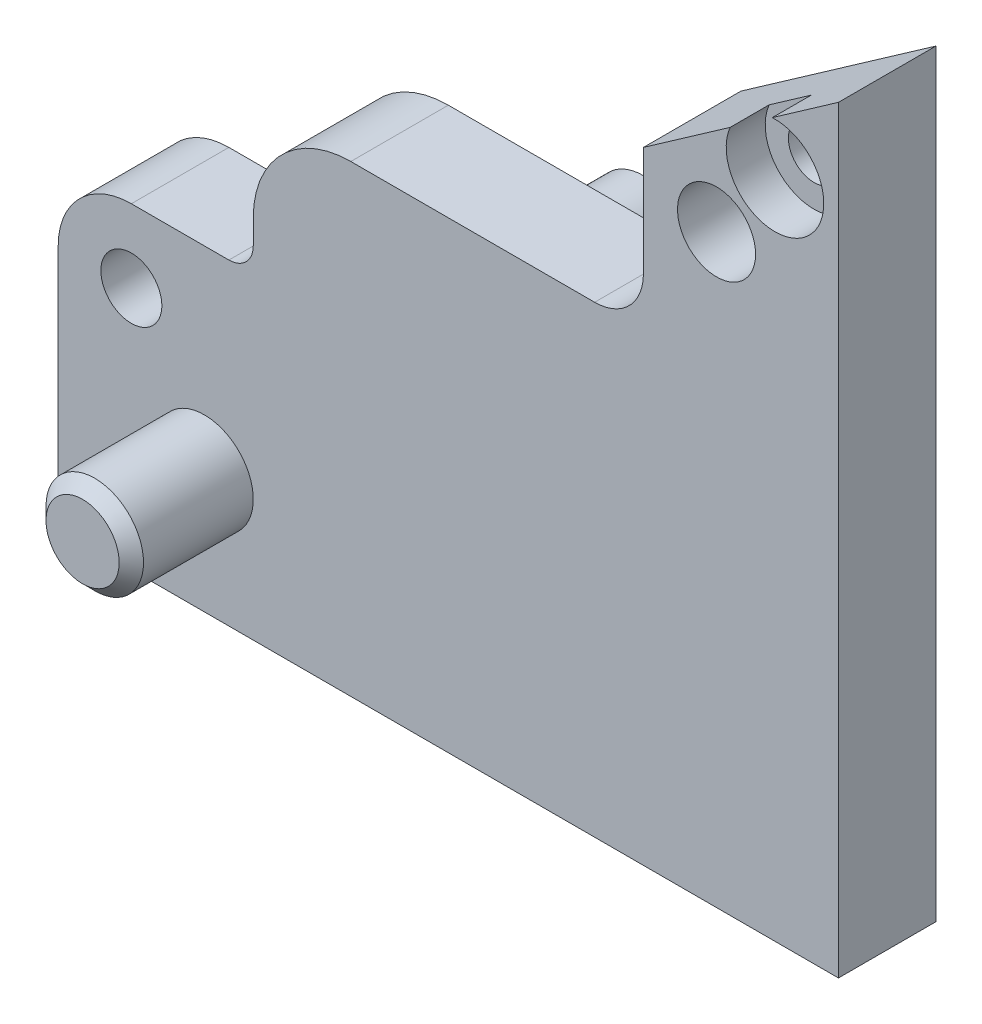
ISO-10303-21;
HEADER;
FILE_DESCRIPTION(('STEP AP214'),'2;1');
FILE_NAME('part.step','',(''),(''),'','','');
FILE_SCHEMA(('AUTOMOTIVE_DESIGN { 1 0 10303 214 1 1 1 1 }'));
ENDSEC;
DATA;
#1=APPLICATION_CONTEXT('core data for automotive mechanical design processes');
#2=APPLICATION_PROTOCOL_DEFINITION('international standard','automotive_design',2000,#1);
#3=PRODUCT_CONTEXT('',#1,'mechanical');
#4=PRODUCT('Part','Part','',(#3));
#5=PRODUCT_RELATED_PRODUCT_CATEGORY('part','',(#4));
#6=PRODUCT_DEFINITION_FORMATION('','',#4);
#7=PRODUCT_DEFINITION_CONTEXT('part definition',#1,'design');
#8=PRODUCT_DEFINITION('design','',#6,#7);
#9=PRODUCT_DEFINITION_SHAPE('','',#8);
#10=(LENGTH_UNIT() NAMED_UNIT(*) SI_UNIT(.MILLI.,.METRE.));
#11=(NAMED_UNIT(*) PLANE_ANGLE_UNIT() SI_UNIT($,.RADIAN.));
#12=(NAMED_UNIT(*) SI_UNIT($,.STERADIAN.) SOLID_ANGLE_UNIT());
#13=UNCERTAINTY_MEASURE_WITH_UNIT(LENGTH_MEASURE(1.E-05),#10,'distance_accuracy_value','');
#14=(GEOMETRIC_REPRESENTATION_CONTEXT(3) GLOBAL_UNCERTAINTY_ASSIGNED_CONTEXT((#13)) GLOBAL_UNIT_ASSIGNED_CONTEXT((#10,
#11,#12)) REPRESENTATION_CONTEXT('',''));
#15=CARTESIAN_POINT('',(0.,0.,0.));
#16=DIRECTION('',(0.,0.,1.));
#17=DIRECTION('',(1.,0.,0.));
#18=AXIS2_PLACEMENT_3D('',#15,#16,#17);
#19=CARTESIAN_POINT('',(32.,0.,4.));
#20=DIRECTION('',(0.,-1.,0.));
#21=DIRECTION('',(0.,0.,-1.));
#22=AXIS2_PLACEMENT_3D('',#19,#20,#21);
#23=PLANE('',#22);
#24=CARTESIAN_POINT('',(10.,0.,2.));
#25=DIRECTION('',(0.,-1.,0.));
#26=DIRECTION('',(0.,0.,-1.));
#27=AXIS2_PLACEMENT_3D('',#24,#25,#26);
#28=CIRCLE('',#27,1.24999999999999);
#29=CARTESIAN_POINT('',(10.,0.,0.750000000000011));
#30=VERTEX_POINT('',#29);
#31=EDGE_CURVE('E151',#30,#30,#28,.T.);
#32=ORIENTED_EDGE('',*,*,#31,.F.);
#33=EDGE_LOOP('',(#32));
#34=FACE_BOUND('',#33,.T.);
#35=CARTESIAN_POINT('',(19.5,0.,2.));
#36=DIRECTION('',(0.,-1.,0.));
#37=DIRECTION('',(0.,0.,-1.));
#38=AXIS2_PLACEMENT_3D('',#35,#36,#37);
#39=CIRCLE('',#38,1.24999999999999);
#40=CARTESIAN_POINT('',(19.5,0.,0.750000000000013));
#41=VERTEX_POINT('',#40);
#42=EDGE_CURVE('E150',#41,#41,#39,.T.);
#43=ORIENTED_EDGE('',*,*,#42,.F.);
#44=EDGE_LOOP('',(#43));
#45=FACE_BOUND('',#44,.T.);
#46=CARTESIAN_POINT('',(29.,0.,2.));
#47=DIRECTION('',(0.,-1.,0.));
#48=DIRECTION('',(0.,0.,-1.));
#49=AXIS2_PLACEMENT_3D('',#46,#47,#48);
#50=CIRCLE('',#49,1.24999999999999);
#51=CARTESIAN_POINT('',(29.,0.,0.750000000000013));
#52=VERTEX_POINT('',#51);
#53=EDGE_CURVE('E161',#52,#52,#50,.T.);
#54=ORIENTED_EDGE('',*,*,#53,.F.);
#55=EDGE_LOOP('',(#54));
#56=FACE_BOUND('',#55,.T.);
#57=DIRECTION('',(-1.,0.,0.));
#58=VECTOR('',#57,1.);
#59=CARTESIAN_POINT('',(32.,0.,0.));
#60=LINE('',#59,#58);
#61=CARTESIAN_POINT('',(32.,0.,0.));
#62=VERTEX_POINT('',#61);
#63=CARTESIAN_POINT('',(0.,0.,0.));
#64=VERTEX_POINT('',#63);
#65=EDGE_CURVE('E205',#62,#64,#60,.T.);
#66=ORIENTED_EDGE('',*,*,#65,.F.);
#67=DIRECTION('',(0.,0.,-1.));
#68=VECTOR('',#67,1.);
#69=CARTESIAN_POINT('',(32.,0.,4.));
#70=LINE('',#69,#68);
#71=CARTESIAN_POINT('',(32.,0.,4.));
#72=VERTEX_POINT('',#71);
#73=EDGE_CURVE('E230',#72,#62,#70,.T.);
#74=ORIENTED_EDGE('',*,*,#73,.F.);
#75=DIRECTION('',(-1.,0.,0.));
#76=VECTOR('',#75,1.);
#77=CARTESIAN_POINT('',(32.,0.,4.));
#78=LINE('',#77,#76);
#79=CARTESIAN_POINT('',(0.,0.,4.));
#80=VERTEX_POINT('',#79);
#81=EDGE_CURVE('E209',#72,#80,#78,.T.);
#82=ORIENTED_EDGE('',*,*,#81,.T.);
#83=DIRECTION('',(0.,0.,-1.));
#84=VECTOR('',#83,1.);
#85=CARTESIAN_POINT('',(0.,0.,4.));
#86=LINE('',#85,#84);
#87=EDGE_CURVE('E220',#80,#64,#86,.T.);
#88=ORIENTED_EDGE('',*,*,#87,.T.);
#89=EDGE_LOOP('',(#66,#74,#82,#88));
#90=FACE_BOUND('',#89,.T.);
#91=ADVANCED_FACE('F32',(#34,#45,#56,#90),#23,.T.);
#92=CARTESIAN_POINT('',(32.,31.101660306,4.));
#93=DIRECTION('',(1.,0.,0.));
#94=DIRECTION('',(0.,0.,-1.));
#95=AXIS2_PLACEMENT_3D('',#92,#93,#94);
#96=PLANE('',#95);
#97=DIRECTION('',(0.,-1.,0.));
#98=VECTOR('',#97,1.);
#99=CARTESIAN_POINT('',(32.,31.101660306,0.));
#100=LINE('',#99,#98);
#101=CARTESIAN_POINT('',(32.,31.101660306,0.));
#102=VERTEX_POINT('',#101);
#103=EDGE_CURVE('E213',#102,#62,#100,.T.);
#104=ORIENTED_EDGE('',*,*,#103,.F.);
#105=DIRECTION('',(0.,0.,-1.));
#106=VECTOR('',#105,1.);
#107=CARTESIAN_POINT('',(32.,31.101660306,4.));
#108=LINE('',#107,#106);
#109=CARTESIAN_POINT('',(32.,31.101660306,4.));
#110=VERTEX_POINT('',#109);
#111=EDGE_CURVE('E233',#110,#102,#108,.T.);
#112=ORIENTED_EDGE('',*,*,#111,.F.);
#113=DIRECTION('',(0.,-1.,0.));
#114=VECTOR('',#113,1.);
#115=CARTESIAN_POINT('',(32.,31.101660306,4.));
#116=LINE('',#115,#114);
#117=EDGE_CURVE('E217',#110,#72,#116,.T.);
#118=ORIENTED_EDGE('',*,*,#117,.T.);
#119=ORIENTED_EDGE('',*,*,#73,.T.);
#120=EDGE_LOOP('',(#104,#112,#118,#119));
#121=FACE_BOUND('',#120,.T.);
#122=ADVANCED_FACE('F327',(#121),#96,.T.);
#123=CARTESIAN_POINT('',(32.,31.101660306,4.));
#124=DIRECTION('',(-0.573576436373189,0.819152044273487,0.));
#125=DIRECTION('',(-0.819152044273487,-0.573576436373189,0.));
#126=AXIS2_PLACEMENT_3D('',#123,#124,#125);
#127=PLANE('',#126);
#128=DIRECTION('',(0.,0.,1.));
#129=VECTOR('',#128,1.);
#130=CARTESIAN_POINT('',(27.5578850091411,27.9912579036273,4.));
#131=LINE('',#130,#129);
#132=CARTESIAN_POINT('',(27.5578850091411,27.9912579036273,2.4));
#133=VERTEX_POINT('',#132);
#134=CARTESIAN_POINT('',(27.5578850091411,27.9912579036273,4.));
#135=VERTEX_POINT('',#134);
#136=EDGE_CURVE('E176',#133,#135,#131,.T.);
#137=ORIENTED_EDGE('',*,*,#136,.F.);
#138=DIRECTION('',(-0.819152044273487,-0.573576436373189,0.));
#139=VECTOR('',#138,1.);
#140=CARTESIAN_POINT('',(32.,31.101660306,2.4));
#141=LINE('',#140,#139);
#142=CARTESIAN_POINT('',(29.2839454713184,29.1998584507191,2.4));
#143=VERTEX_POINT('',#142);
#144=EDGE_CURVE('E251',#143,#133,#141,.T.);
#145=ORIENTED_EDGE('',*,*,#144,.F.);
#146=DIRECTION('',(0.,0.,1.));
#147=VECTOR('',#146,1.);
#148=CARTESIAN_POINT('',(29.2839454713184,29.1998584507191,4.));
#149=LINE('',#148,#147);
#150=CARTESIAN_POINT('',(29.2839454713184,29.1998584507191,4.));
#151=VERTEX_POINT('',#150);
#152=EDGE_CURVE('E174',#151,#143,#149,.F.);
#153=ORIENTED_EDGE('',*,*,#152,.F.);
#154=DIRECTION('',(0.819152044273487,0.573576436373189,0.));
#155=VECTOR('',#154,1.);
#156=CARTESIAN_POINT('',(-4.0853226345545,5.83444537710177,4.));
#157=LINE('',#156,#155);
#158=EDGE_CURVE('E216',#151,#110,#157,.T.);
#159=ORIENTED_EDGE('',*,*,#158,.T.);
#160=ORIENTED_EDGE('',*,*,#111,.T.);
#161=DIRECTION('',(0.819152044273487,0.573576436373189,0.));
#162=VECTOR('',#161,1.);
#163=CARTESIAN_POINT('',(-4.0853226345545,5.83444537710177,0.));
#164=LINE('',#163,#162);
#165=CARTESIAN_POINT('',(24.,25.5,0.));
#166=VERTEX_POINT('',#165);
#167=EDGE_CURVE('E227',#166,#102,#164,.T.);
#168=ORIENTED_EDGE('',*,*,#167,.F.);
#169=DIRECTION('',(0.,0.,1.));
#170=VECTOR('',#169,1.);
#171=CARTESIAN_POINT('',(24.,25.5,0.));
#172=LINE('',#171,#170);
#173=CARTESIAN_POINT('',(24.,25.5,4.));
#174=VERTEX_POINT('',#173);
#175=EDGE_CURVE('E197',#166,#174,#172,.T.);
#176=ORIENTED_EDGE('',*,*,#175,.T.);
#177=EDGE_CURVE('E221',#174,#135,#157,.T.);
#178=ORIENTED_EDGE('',*,*,#177,.T.);
#179=EDGE_LOOP('',(#137,#145,#153,#159,#160,#168,#176,#178));
#180=FACE_BOUND('',#179,.T.);
#181=ADVANCED_FACE('F322',(#180),#127,.T.);
#182=CARTESIAN_POINT('',(0.,0.,4.));
#183=DIRECTION('',(-1.,0.,0.));
#184=DIRECTION('',(0.,0.,1.));
#185=AXIS2_PLACEMENT_3D('',#182,#183,#184);
#186=PLANE('',#185);
#187=DIRECTION('',(0.,1.,0.));
#188=VECTOR('',#187,1.);
#189=CARTESIAN_POINT('',(0.,0.,4.));
#190=LINE('',#189,#188);
#191=CARTESIAN_POINT('',(0.,10.,4.));
#192=VERTEX_POINT('',#191);
#193=EDGE_CURVE('E212',#80,#192,#190,.T.);
#194=ORIENTED_EDGE('',*,*,#193,.T.);
#195=DIRECTION('',(0.,0.,1.));
#196=VECTOR('',#195,1.);
#197=CARTESIAN_POINT('',(0.,10.,0.));
#198=LINE('',#197,#196);
#199=CARTESIAN_POINT('',(0.,10.,0.));
#200=VERTEX_POINT('',#199);
#201=EDGE_CURVE('E292',#192,#200,#198,.F.);
#202=ORIENTED_EDGE('',*,*,#201,.T.);
#203=DIRECTION('',(0.,1.,0.));
#204=VECTOR('',#203,1.);
#205=CARTESIAN_POINT('',(0.,0.,0.));
#206=LINE('',#205,#204);
#207=EDGE_CURVE('E224',#64,#200,#206,.T.);
#208=ORIENTED_EDGE('',*,*,#207,.F.);
#209=ORIENTED_EDGE('',*,*,#87,.F.);
#210=EDGE_LOOP('',(#194,#202,#208,#209));
#211=FACE_BOUND('',#210,.T.);
#212=ADVANCED_FACE('F334',(#211),#186,.T.);
#213=CARTESIAN_POINT('',(0.,0.,4.));
#214=DIRECTION('',(0.,0.,-1.));
#215=DIRECTION('',(-1.,0.,0.));
#216=AXIS2_PLACEMENT_3D('',#213,#214,#215);
#217=PLANE('',#216);
#218=CARTESIAN_POINT('',(3.,10.,4.));
#219=DIRECTION('',(0.,0.,-1.));
#220=DIRECTION('',(-1.,0.,0.));
#221=AXIS2_PLACEMENT_3D('',#218,#219,#220);
#222=CIRCLE('',#221,1.24999999999999);
#223=CARTESIAN_POINT('',(1.75000000000001,10.,4.));
#224=VERTEX_POINT('',#223);
#225=EDGE_CURVE('E181',#224,#224,#222,.T.);
#226=ORIENTED_EDGE('',*,*,#225,.T.);
#227=EDGE_LOOP('',(#226));
#228=FACE_BOUND('',#227,.T.);
#229=CARTESIAN_POINT('',(27.,24.,4.));
#230=DIRECTION('',(0.,0.,1.));
#231=DIRECTION('',(1.,0.,0.));
#232=AXIS2_PLACEMENT_3D('',#229,#230,#231);
#233=CIRCLE('',#232,1.59999999999999);
#234=CARTESIAN_POINT('',(28.6,24.,4.));
#235=VERTEX_POINT('',#234);
#236=EDGE_CURVE('E182',#235,#235,#233,.T.);
#237=ORIENTED_EDGE('',*,*,#236,.F.);
#238=EDGE_LOOP('',(#237));
#239=FACE_BOUND('',#238,.T.);
#240=CARTESIAN_POINT('',(6.,5.,4.));
#241=DIRECTION('',(0.,0.,-1.));
#242=DIRECTION('',(-1.,0.,0.));
#243=AXIS2_PLACEMENT_3D('',#240,#241,#242);
#244=CIRCLE('',#243,2.);
#245=CARTESIAN_POINT('',(4.,5.,4.));
#246=VERTEX_POINT('',#245);
#247=EDGE_CURVE('E188',#246,#246,#244,.T.);
#248=ORIENTED_EDGE('',*,*,#247,.T.);
#249=EDGE_LOOP('',(#248));
#250=FACE_BOUND('',#249,.T.);
#251=DIRECTION('',(1.,0.,0.));
#252=VECTOR('',#251,1.);
#253=CARTESIAN_POINT('',(8.,19.,4.));
#254=LINE('',#253,#252);
#255=CARTESIAN_POINT('',(12.,19.,4.));
#256=VERTEX_POINT('',#255);
#257=CARTESIAN_POINT('',(22.,19.,4.));
#258=VERTEX_POINT('',#257);
#259=EDGE_CURVE('E191',#256,#258,#254,.T.);
#260=ORIENTED_EDGE('',*,*,#259,.F.);
#261=CARTESIAN_POINT('',(12.,15.,4.));
#262=DIRECTION('',(0.,0.,-1.));
#263=DIRECTION('',(-1.,0.,0.));
#264=AXIS2_PLACEMENT_3D('',#261,#262,#263);
#265=CIRCLE('',#264,4.);
#266=CARTESIAN_POINT('',(8.,15.,4.));
#267=VERTEX_POINT('',#266);
#268=EDGE_CURVE('E54',#256,#267,#265,.F.);
#269=ORIENTED_EDGE('',*,*,#268,.T.);
#270=DIRECTION('',(0.,1.,0.));
#271=VECTOR('',#270,1.);
#272=CARTESIAN_POINT('',(8.,13.,4.));
#273=LINE('',#272,#271);
#274=CARTESIAN_POINT('',(8.,14.,4.));
#275=VERTEX_POINT('',#274);
#276=EDGE_CURVE('E203',#275,#267,#273,.T.);
#277=ORIENTED_EDGE('',*,*,#276,.F.);
#278=CARTESIAN_POINT('',(7.,14.,4.));
#279=DIRECTION('',(0.,0.,-1.));
#280=DIRECTION('',(-1.,0.,0.));
#281=AXIS2_PLACEMENT_3D('',#278,#279,#280);
#282=CIRCLE('',#281,1.);
#283=CARTESIAN_POINT('',(7.,13.,4.));
#284=VERTEX_POINT('',#283);
#285=EDGE_CURVE('E271',#275,#284,#282,.T.);
#286=ORIENTED_EDGE('',*,*,#285,.T.);
#287=DIRECTION('',(1.,0.,0.));
#288=VECTOR('',#287,1.);
#289=CARTESIAN_POINT('',(0.,13.,4.));
#290=LINE('',#289,#288);
#291=CARTESIAN_POINT('',(3.,13.,4.));
#292=VERTEX_POINT('',#291);
#293=EDGE_CURVE('E206',#292,#284,#290,.T.);
#294=ORIENTED_EDGE('',*,*,#293,.F.);
#295=CARTESIAN_POINT('',(3.,10.,4.));
#296=DIRECTION('',(0.,0.,-1.));
#297=DIRECTION('',(-1.,0.,0.));
#298=AXIS2_PLACEMENT_3D('',#295,#296,#297);
#299=CIRCLE('',#298,3.);
#300=EDGE_CURVE('E290',#292,#192,#299,.F.);
#301=ORIENTED_EDGE('',*,*,#300,.T.);
#302=ORIENTED_EDGE('',*,*,#193,.F.);
#303=ORIENTED_EDGE('',*,*,#81,.F.);
#304=ORIENTED_EDGE('',*,*,#117,.F.);
#305=ORIENTED_EDGE('',*,*,#158,.F.);
#306=CARTESIAN_POINT('',(29.395995182,27.202999702,4.));
#307=DIRECTION('',(0.,0.,-1.));
#308=DIRECTION('',(-1.,0.,0.));
#309=AXIS2_PLACEMENT_3D('',#306,#307,#308);
#310=CIRCLE('',#309,1.99999999999999);
#311=EDGE_CURVE('E244',#151,#135,#310,.T.);
#312=ORIENTED_EDGE('',*,*,#311,.T.);
#313=ORIENTED_EDGE('',*,*,#177,.F.);
#314=DIRECTION('',(0.,1.,0.));
#315=VECTOR('',#314,1.);
#316=CARTESIAN_POINT('',(24.,19.,4.));
#317=LINE('',#316,#315);
#318=CARTESIAN_POINT('',(24.,21.,4.));
#319=VERTEX_POINT('',#318);
#320=EDGE_CURVE('E195',#319,#174,#317,.T.);
#321=ORIENTED_EDGE('',*,*,#320,.F.);
#322=CARTESIAN_POINT('',(22.,21.,4.));
#323=DIRECTION('',(0.,0.,-1.));
#324=DIRECTION('',(-1.,0.,0.));
#325=AXIS2_PLACEMENT_3D('',#322,#323,#324);
#326=CIRCLE('',#325,2.);
#327=EDGE_CURVE('E282',#319,#258,#326,.T.);
#328=ORIENTED_EDGE('',*,*,#327,.T.);
#329=EDGE_LOOP('',(#260,#269,#277,#286,#294,#301,#302,#303,#304,#305,#312,#313,#321,#328));
#330=FACE_BOUND('',#329,.T.);
#331=ADVANCED_FACE('F305',(#228,#239,#250,#330),#217,.F.);
#332=CARTESIAN_POINT('',(0.,0.,0.));
#333=DIRECTION('',(0.,0.,-1.));
#334=DIRECTION('',(-1.,0.,0.));
#335=AXIS2_PLACEMENT_3D('',#332,#333,#334);
#336=PLANE('',#335);
#337=CARTESIAN_POINT('',(29.395995182,27.202999702,0.));
#338=DIRECTION('',(0.,0.,-1.));
#339=DIRECTION('',(-1.,0.,0.));
#340=AXIS2_PLACEMENT_3D('',#337,#338,#339);
#341=CIRCLE('',#340,1.05000000000001);
#342=CARTESIAN_POINT('',(28.345995182,27.202999702,0.));
#343=VERTEX_POINT('',#342);
#344=EDGE_CURVE('E173',#343,#343,#341,.T.);
#345=ORIENTED_EDGE('',*,*,#344,.F.);
#346=EDGE_LOOP('',(#345));
#347=FACE_BOUND('',#346,.T.);
#348=CARTESIAN_POINT('',(3.,10.,0.));
#349=DIRECTION('',(0.,0.,-1.));
#350=DIRECTION('',(-1.,0.,0.));
#351=AXIS2_PLACEMENT_3D('',#348,#349,#350);
#352=CIRCLE('',#351,1.24999999999999);
#353=CARTESIAN_POINT('',(1.75000000000001,10.,0.));
#354=VERTEX_POINT('',#353);
#355=EDGE_CURVE('E178',#354,#354,#352,.T.);
#356=ORIENTED_EDGE('',*,*,#355,.F.);
#357=EDGE_LOOP('',(#356));
#358=FACE_BOUND('',#357,.T.);
#359=CARTESIAN_POINT('',(27.,24.,0.));
#360=DIRECTION('',(0.,0.,-1.));
#361=DIRECTION('',(-1.,0.,0.));
#362=AXIS2_PLACEMENT_3D('',#359,#360,#361);
#363=CIRCLE('',#362,1.59999999999999);
#364=CARTESIAN_POINT('',(25.4,24.,0.));
#365=VERTEX_POINT('',#364);
#366=EDGE_CURVE('E185',#365,#365,#363,.T.);
#367=ORIENTED_EDGE('',*,*,#366,.F.);
#368=EDGE_LOOP('',(#367));
#369=FACE_BOUND('',#368,.T.);
#370=CARTESIAN_POINT('',(15.5,14.,0.));
#371=DIRECTION('',(0.,0.,-1.));
#372=DIRECTION('',(-1.,0.,0.));
#373=AXIS2_PLACEMENT_3D('',#370,#371,#372);
#374=CIRCLE('',#373,2.);
#375=CARTESIAN_POINT('',(13.5,14.,0.));
#376=VERTEX_POINT('',#375);
#377=EDGE_CURVE('E232',#376,#376,#374,.T.);
#378=ORIENTED_EDGE('',*,*,#377,.F.);
#379=EDGE_LOOP('',(#378));
#380=FACE_BOUND('',#379,.T.);
#381=DIRECTION('',(0.,1.,0.));
#382=VECTOR('',#381,1.);
#383=CARTESIAN_POINT('',(8.,13.,0.));
#384=LINE('',#383,#382);
#385=CARTESIAN_POINT('',(8.,14.,0.));
#386=VERTEX_POINT('',#385);
#387=CARTESIAN_POINT('',(8.,15.,0.));
#388=VERTEX_POINT('',#387);
#389=EDGE_CURVE('E202',#386,#388,#384,.T.);
#390=ORIENTED_EDGE('',*,*,#389,.T.);
#391=CARTESIAN_POINT('',(12.,15.,0.));
#392=DIRECTION('',(0.,0.,-1.));
#393=DIRECTION('',(-1.,0.,0.));
#394=AXIS2_PLACEMENT_3D('',#391,#392,#393);
#395=CIRCLE('',#394,4.);
#396=CARTESIAN_POINT('',(12.,19.,0.));
#397=VERTEX_POINT('',#396);
#398=EDGE_CURVE('E11',#388,#397,#395,.T.);
#399=ORIENTED_EDGE('',*,*,#398,.T.);
#400=DIRECTION('',(1.,0.,0.));
#401=VECTOR('',#400,1.);
#402=CARTESIAN_POINT('',(8.,19.,0.));
#403=LINE('',#402,#401);
#404=CARTESIAN_POINT('',(22.,19.,0.));
#405=VERTEX_POINT('',#404);
#406=EDGE_CURVE('E192',#397,#405,#403,.T.);
#407=ORIENTED_EDGE('',*,*,#406,.T.);
#408=CARTESIAN_POINT('',(22.,21.,0.));
#409=DIRECTION('',(0.,0.,-1.));
#410=DIRECTION('',(-1.,0.,0.));
#411=AXIS2_PLACEMENT_3D('',#408,#409,#410);
#412=CIRCLE('',#411,2.);
#413=CARTESIAN_POINT('',(24.,21.,0.));
#414=VERTEX_POINT('',#413);
#415=EDGE_CURVE('E285',#405,#414,#412,.F.);
#416=ORIENTED_EDGE('',*,*,#415,.T.);
#417=DIRECTION('',(0.,1.,0.));
#418=VECTOR('',#417,1.);
#419=CARTESIAN_POINT('',(24.,19.,0.));
#420=LINE('',#419,#418);
#421=EDGE_CURVE('E194',#414,#166,#420,.T.);
#422=ORIENTED_EDGE('',*,*,#421,.T.);
#423=ORIENTED_EDGE('',*,*,#167,.T.);
#424=ORIENTED_EDGE('',*,*,#103,.T.);
#425=ORIENTED_EDGE('',*,*,#65,.T.);
#426=ORIENTED_EDGE('',*,*,#207,.T.);
#427=CARTESIAN_POINT('',(3.,10.,0.));
#428=DIRECTION('',(0.,0.,-1.));
#429=DIRECTION('',(-1.,0.,0.));
#430=AXIS2_PLACEMENT_3D('',#427,#428,#429);
#431=CIRCLE('',#430,3.);
#432=CARTESIAN_POINT('',(3.,13.,0.));
#433=VERTEX_POINT('',#432);
#434=EDGE_CURVE('E294',#200,#433,#431,.T.);
#435=ORIENTED_EDGE('',*,*,#434,.T.);
#436=DIRECTION('',(1.,0.,0.));
#437=VECTOR('',#436,1.);
#438=CARTESIAN_POINT('',(0.,13.,0.));
#439=LINE('',#438,#437);
#440=CARTESIAN_POINT('',(7.,13.,0.));
#441=VERTEX_POINT('',#440);
#442=EDGE_CURVE('E200',#433,#441,#439,.T.);
#443=ORIENTED_EDGE('',*,*,#442,.T.);
#444=CARTESIAN_POINT('',(7.,14.,0.));
#445=DIRECTION('',(0.,0.,-1.));
#446=DIRECTION('',(-1.,0.,0.));
#447=AXIS2_PLACEMENT_3D('',#444,#445,#446);
#448=CIRCLE('',#447,1.);
#449=EDGE_CURVE('E274',#441,#386,#448,.F.);
#450=ORIENTED_EDGE('',*,*,#449,.T.);
#451=EDGE_LOOP('',(#390,#399,#407,#416,#422,#423,#424,#425,#426,#435,#443,#450));
#452=FACE_BOUND('',#451,.T.);
#453=ADVANCED_FACE('F315',(#347,#358,#369,#380,#452),#336,.T.);
#454=CARTESIAN_POINT('',(8.,13.,0.));
#455=DIRECTION('',(1.,0.,0.));
#456=DIRECTION('',(0.,0.,-1.));
#457=AXIS2_PLACEMENT_3D('',#454,#455,#456);
#458=PLANE('',#457);
#459=ORIENTED_EDGE('',*,*,#276,.T.);
#460=DIRECTION('',(0.,0.,1.));
#461=VECTOR('',#460,1.);
#462=CARTESIAN_POINT('',(8.,15.,0.));
#463=LINE('',#462,#461);
#464=EDGE_CURVE('E40',#267,#388,#463,.F.);
#465=ORIENTED_EDGE('',*,*,#464,.T.);
#466=ORIENTED_EDGE('',*,*,#389,.F.);
#467=DIRECTION('',(0.,0.,1.));
#468=VECTOR('',#467,1.);
#469=CARTESIAN_POINT('',(8.,14.,4.));
#470=LINE('',#469,#468);
#471=EDGE_CURVE('E265',#386,#275,#470,.T.);
#472=ORIENTED_EDGE('',*,*,#471,.T.);
#473=EDGE_LOOP('',(#459,#465,#466,#472));
#474=FACE_BOUND('',#473,.T.);
#475=ADVANCED_FACE('F349',(#474),#458,.F.);
#476=CARTESIAN_POINT('',(0.,13.,0.));
#477=DIRECTION('',(0.,-1.,0.));
#478=DIRECTION('',(0.,0.,-1.));
#479=AXIS2_PLACEMENT_3D('',#476,#477,#478);
#480=PLANE('',#479);
#481=ORIENTED_EDGE('',*,*,#442,.F.);
#482=DIRECTION('',(0.,0.,1.));
#483=VECTOR('',#482,1.);
#484=CARTESIAN_POINT('',(3.,13.,4.));
#485=LINE('',#484,#483);
#486=EDGE_CURVE('E287',#433,#292,#485,.T.);
#487=ORIENTED_EDGE('',*,*,#486,.T.);
#488=ORIENTED_EDGE('',*,*,#293,.T.);
#489=DIRECTION('',(0.,0.,1.));
#490=VECTOR('',#489,1.);
#491=CARTESIAN_POINT('',(7.,13.,0.));
#492=LINE('',#491,#490);
#493=EDGE_CURVE('E268',#284,#441,#492,.F.);
#494=ORIENTED_EDGE('',*,*,#493,.T.);
#495=EDGE_LOOP('',(#481,#487,#488,#494));
#496=FACE_BOUND('',#495,.T.);
#497=ADVANCED_FACE('F343',(#496),#480,.F.);
#498=CARTESIAN_POINT('',(24.,19.,0.));
#499=DIRECTION('',(1.,0.,0.));
#500=DIRECTION('',(0.,1.,0.));
#501=AXIS2_PLACEMENT_3D('',#498,#499,#500);
#502=PLANE('',#501);
#503=ORIENTED_EDGE('',*,*,#421,.F.);
#504=DIRECTION('',(0.,0.,1.));
#505=VECTOR('',#504,1.);
#506=CARTESIAN_POINT('',(24.,21.,4.));
#507=LINE('',#506,#505);
#508=EDGE_CURVE('E276',#414,#319,#507,.T.);
#509=ORIENTED_EDGE('',*,*,#508,.T.);
#510=ORIENTED_EDGE('',*,*,#320,.T.);
#511=ORIENTED_EDGE('',*,*,#175,.F.);
#512=EDGE_LOOP('',(#503,#509,#510,#511));
#513=FACE_BOUND('',#512,.T.);
#514=ADVANCED_FACE('F318',(#513),#502,.F.);
#515=CARTESIAN_POINT('',(8.,19.,0.));
#516=DIRECTION('',(0.,-1.,0.));
#517=DIRECTION('',(0.,0.,-1.));
#518=AXIS2_PLACEMENT_3D('',#515,#516,#517);
#519=PLANE('',#518);
#520=ORIENTED_EDGE('',*,*,#406,.F.);
#521=DIRECTION('',(0.,0.,1.));
#522=VECTOR('',#521,1.);
#523=CARTESIAN_POINT('',(12.,19.,0.));
#524=LINE('',#523,#522);
#525=EDGE_CURVE('E296',#397,#256,#524,.T.);
#526=ORIENTED_EDGE('',*,*,#525,.T.);
#527=ORIENTED_EDGE('',*,*,#259,.T.);
#528=DIRECTION('',(0.,0.,1.));
#529=VECTOR('',#528,1.);
#530=CARTESIAN_POINT('',(22.,19.,0.));
#531=LINE('',#530,#529);
#532=EDGE_CURVE('E279',#258,#405,#531,.F.);
#533=ORIENTED_EDGE('',*,*,#532,.T.);
#534=EDGE_LOOP('',(#520,#526,#527,#533));
#535=FACE_BOUND('',#534,.T.);
#536=ADVANCED_FACE('F302',(#535),#519,.F.);
#537=CARTESIAN_POINT('',(6.,5.,9.));
#538=DIRECTION('',(0.,0.,-1.));
#539=DIRECTION('',(-1.,0.,0.));
#540=AXIS2_PLACEMENT_3D('',#537,#538,#539);
#541=CYLINDRICAL_SURFACE('',#540,2.);
#542=CARTESIAN_POINT('',(6.,5.,8.50000000000025));
#543=DIRECTION('',(0.,0.,1.));
#544=DIRECTION('',(1.,0.,0.));
#545=AXIS2_PLACEMENT_3D('',#542,#543,#544);
#546=CIRCLE('',#545,2.);
#547=CARTESIAN_POINT('',(8.,5.,8.50000000000025));
#548=VERTEX_POINT('',#547);
#549=EDGE_CURVE('E253',#548,#548,#546,.F.);
#550=ORIENTED_EDGE('',*,*,#549,.T.);
#551=EDGE_LOOP('',(#550));
#552=FACE_BOUND('',#551,.T.);
#553=ORIENTED_EDGE('',*,*,#247,.F.);
#554=EDGE_LOOP('',(#553));
#555=FACE_BOUND('',#554,.T.);
#556=ADVANCED_FACE('F429',(#552,#555),#541,.T.);
#557=CARTESIAN_POINT('',(8.,5.,9.));
#558=DIRECTION('',(0.,0.,1.));
#559=DIRECTION('',(1.,0.,0.));
#560=AXIS2_PLACEMENT_3D('',#557,#558,#559);
#561=PLANE('',#560);
#562=CARTESIAN_POINT('',(6.,5.,9.));
#563=DIRECTION('',(0.,0.,1.));
#564=DIRECTION('',(1.,0.,0.));
#565=AXIS2_PLACEMENT_3D('',#562,#563,#564);
#566=CIRCLE('',#565,1.50000000000025);
#567=CARTESIAN_POINT('',(7.50000000000025,5.,9.));
#568=VERTEX_POINT('',#567);
#569=EDGE_CURVE('E256',#568,#568,#566,.T.);
#570=ORIENTED_EDGE('',*,*,#569,.T.);
#571=EDGE_LOOP('',(#570));
#572=FACE_BOUND('',#571,.T.);
#573=ADVANCED_FACE('F445',(#572),#561,.T.);
#574=CARTESIAN_POINT('',(15.5,14.,-5.));
#575=DIRECTION('',(0.,0.,1.));
#576=DIRECTION('',(1.,0.,0.));
#577=AXIS2_PLACEMENT_3D('',#574,#575,#576);
#578=CYLINDRICAL_SURFACE('',#577,2.);
#579=CARTESIAN_POINT('',(15.5,14.,-4.50000000000025));
#580=DIRECTION('',(0.,0.,-1.));
#581=DIRECTION('',(-1.,0.,0.));
#582=AXIS2_PLACEMENT_3D('',#579,#580,#581);
#583=CIRCLE('',#582,2.);
#584=CARTESIAN_POINT('',(13.5,14.,-4.50000000000025));
#585=VERTEX_POINT('',#584);
#586=EDGE_CURVE('E259',#585,#585,#583,.F.);
#587=ORIENTED_EDGE('',*,*,#586,.T.);
#588=EDGE_LOOP('',(#587));
#589=FACE_BOUND('',#588,.T.);
#590=ORIENTED_EDGE('',*,*,#377,.T.);
#591=EDGE_LOOP('',(#590));
#592=FACE_BOUND('',#591,.T.);
#593=ADVANCED_FACE('F453',(#589,#592),#578,.T.);
#594=CARTESIAN_POINT('',(17.5,14.,-5.));
#595=DIRECTION('',(0.,0.,-1.));
#596=DIRECTION('',(-1.,0.,0.));
#597=AXIS2_PLACEMENT_3D('',#594,#595,#596);
#598=PLANE('',#597);
#599=CARTESIAN_POINT('',(15.5,14.,-5.));
#600=DIRECTION('',(0.,0.,-1.));
#601=DIRECTION('',(-1.,0.,0.));
#602=AXIS2_PLACEMENT_3D('',#599,#600,#601);
#603=CIRCLE('',#602,1.50000000000025);
#604=CARTESIAN_POINT('',(13.9999999999997,14.,-5.));
#605=VERTEX_POINT('',#604);
#606=EDGE_CURVE('E262',#605,#605,#603,.T.);
#607=ORIENTED_EDGE('',*,*,#606,.T.);
#608=EDGE_LOOP('',(#607));
#609=FACE_BOUND('',#608,.T.);
#610=ADVANCED_FACE('F461',(#609),#598,.T.);
#611=CARTESIAN_POINT('',(27.,24.,4.));
#612=DIRECTION('',(0.,0.,1.));
#613=DIRECTION('',(1.,0.,0.));
#614=AXIS2_PLACEMENT_3D('',#611,#612,#613);
#615=CYLINDRICAL_SURFACE('',#614,1.59999999999999);
#616=ORIENTED_EDGE('',*,*,#366,.T.);
#617=EDGE_LOOP('',(#616));
#618=FACE_BOUND('',#617,.T.);
#619=ORIENTED_EDGE('',*,*,#236,.T.);
#620=EDGE_LOOP('',(#619));
#621=FACE_BOUND('',#620,.T.);
#622=ADVANCED_FACE('F469',(#618,#621),#615,.F.);
#623=CARTESIAN_POINT('',(3.,10.,0.));
#624=DIRECTION('',(0.,0.,-1.));
#625=DIRECTION('',(-1.,0.,0.));
#626=AXIS2_PLACEMENT_3D('',#623,#624,#625);
#627=CYLINDRICAL_SURFACE('',#626,1.24999999999999);
#628=ORIENTED_EDGE('',*,*,#355,.T.);
#629=EDGE_LOOP('',(#628));
#630=FACE_BOUND('',#629,.T.);
#631=ORIENTED_EDGE('',*,*,#225,.F.);
#632=EDGE_LOOP('',(#631));
#633=FACE_BOUND('',#632,.T.);
#634=ADVANCED_FACE('F478',(#630,#633),#627,.F.);
#635=CARTESIAN_POINT('',(29.395995182,27.202999702,4.));
#636=DIRECTION('',(0.,0.,1.));
#637=DIRECTION('',(1.,0.,0.));
#638=AXIS2_PLACEMENT_3D('',#635,#636,#637);
#639=CYLINDRICAL_SURFACE('',#638,1.05000000000001);
#640=ORIENTED_EDGE('',*,*,#344,.T.);
#641=EDGE_LOOP('',(#640));
#642=FACE_BOUND('',#641,.T.);
#643=CARTESIAN_POINT('',(29.395995182,27.202999702,2.4));
#644=DIRECTION('',(0.,0.,1.));
#645=DIRECTION('',(1.,0.,0.));
#646=AXIS2_PLACEMENT_3D('',#643,#644,#645);
#647=CIRCLE('',#646,1.05000000000001);
#648=CARTESIAN_POINT('',(30.445995182,27.202999702,2.4));
#649=VERTEX_POINT('',#648);
#650=EDGE_CURVE('E170',#649,#649,#647,.T.);
#651=ORIENTED_EDGE('',*,*,#650,.T.);
#652=EDGE_LOOP('',(#651));
#653=FACE_BOUND('',#652,.T.);
#654=ADVANCED_FACE('F487',(#642,#653),#639,.F.);
#655=CARTESIAN_POINT('',(30.445995182,27.202999702,2.4));
#656=DIRECTION('',(0.,0.,-1.));
#657=DIRECTION('',(-1.,0.,0.));
#658=AXIS2_PLACEMENT_3D('',#655,#656,#657);
#659=PLANE('',#658);
#660=ORIENTED_EDGE('',*,*,#144,.T.);
#661=CARTESIAN_POINT('',(29.395995182,27.202999702,2.4));
#662=DIRECTION('',(0.,0.,1.));
#663=DIRECTION('',(1.,0.,0.));
#664=AXIS2_PLACEMENT_3D('',#661,#662,#663);
#665=CIRCLE('',#664,1.99999999999999);
#666=EDGE_CURVE('E167',#133,#143,#665,.T.);
#667=ORIENTED_EDGE('',*,*,#666,.T.);
#668=EDGE_LOOP('',(#660,#667));
#669=FACE_BOUND('',#668,.T.);
#670=ORIENTED_EDGE('',*,*,#650,.F.);
#671=EDGE_LOOP('',(#670));
#672=FACE_BOUND('',#671,.T.);
#673=ADVANCED_FACE('F496',(#669,#672),#659,.F.);
#674=CARTESIAN_POINT('',(29.395995182,27.202999702,4.));
#675=DIRECTION('',(0.,0.,1.));
#676=DIRECTION('',(1.,0.,0.));
#677=AXIS2_PLACEMENT_3D('',#674,#675,#676);
#678=CYLINDRICAL_SURFACE('',#677,1.99999999999999);
#679=ORIENTED_EDGE('',*,*,#136,.T.);
#680=ORIENTED_EDGE('',*,*,#311,.F.);
#681=ORIENTED_EDGE('',*,*,#152,.T.);
#682=ORIENTED_EDGE('',*,*,#666,.F.);
#683=EDGE_LOOP('',(#679,#680,#681,#682));
#684=FACE_BOUND('',#683,.T.);
#685=ADVANCED_FACE('F504',(#684),#678,.F.);
#686=CARTESIAN_POINT('',(29.,7.49999999999999,2.));
#687=DIRECTION('',(0.,-1.,0.));
#688=DIRECTION('',(0.,0.,-1.));
#689=AXIS2_PLACEMENT_3D('',#686,#687,#688);
#690=CONICAL_SURFACE('',#689,1.24999999999999,1.02974425854996);
#691=CARTESIAN_POINT('',(29.,8.25107577399999,2.));
#692=VERTEX_POINT('',#691);
#693=VERTEX_LOOP('',#692);
#694=FACE_BOUND('',#693,.T.);
#695=CARTESIAN_POINT('',(29.,7.49999999999999,2.));
#696=DIRECTION('',(0.,-1.,0.));
#697=DIRECTION('',(0.,0.,-1.));
#698=AXIS2_PLACEMENT_3D('',#695,#696,#697);
#699=CIRCLE('',#698,1.24999999999999);
#700=CARTESIAN_POINT('',(29.,7.49999999999999,0.750000000000013));
#701=VERTEX_POINT('',#700);
#702=EDGE_CURVE('E164',#701,#701,#699,.T.);
#703=ORIENTED_EDGE('',*,*,#702,.T.);
#704=EDGE_LOOP('',(#703));
#705=FACE_BOUND('',#704,.T.);
#706=ADVANCED_FACE('F512',(#694,#705),#690,.F.);
#707=CARTESIAN_POINT('',(29.,0.,2.));
#708=DIRECTION('',(0.,-1.,0.));
#709=DIRECTION('',(0.,0.,-1.));
#710=AXIS2_PLACEMENT_3D('',#707,#708,#709);
#711=CYLINDRICAL_SURFACE('',#710,1.24999999999999);
#712=ORIENTED_EDGE('',*,*,#702,.F.);
#713=EDGE_LOOP('',(#712));
#714=FACE_BOUND('',#713,.T.);
#715=ORIENTED_EDGE('',*,*,#53,.T.);
#716=EDGE_LOOP('',(#715));
#717=FACE_BOUND('',#716,.T.);
#718=ADVANCED_FACE('F520',(#714,#717),#711,.F.);
#719=CARTESIAN_POINT('',(19.5,7.49999999999999,2.));
#720=DIRECTION('',(0.,-1.,0.));
#721=DIRECTION('',(0.,0.,-1.));
#722=AXIS2_PLACEMENT_3D('',#719,#720,#721);
#723=CONICAL_SURFACE('',#722,1.24999999999999,1.02974425854996);
#724=CARTESIAN_POINT('',(19.5,8.25107577399999,2.));
#725=VERTEX_POINT('',#724);
#726=VERTEX_LOOP('',#725);
#727=FACE_BOUND('',#726,.T.);
#728=CARTESIAN_POINT('',(19.5,7.49999999999999,2.));
#729=DIRECTION('',(0.,-1.,0.));
#730=DIRECTION('',(0.,0.,-1.));
#731=AXIS2_PLACEMENT_3D('',#728,#729,#730);
#732=CIRCLE('',#731,1.24999999999999);
#733=CARTESIAN_POINT('',(19.5,7.49999999999999,0.750000000000013));
#734=VERTEX_POINT('',#733);
#735=EDGE_CURVE('E154',#734,#734,#732,.T.);
#736=ORIENTED_EDGE('',*,*,#735,.T.);
#737=EDGE_LOOP('',(#736));
#738=FACE_BOUND('',#737,.T.);
#739=ADVANCED_FACE('F528',(#727,#738),#723,.F.);
#740=CARTESIAN_POINT('',(19.5,0.,2.));
#741=DIRECTION('',(0.,-1.,0.));
#742=DIRECTION('',(0.,0.,-1.));
#743=AXIS2_PLACEMENT_3D('',#740,#741,#742);
#744=CYLINDRICAL_SURFACE('',#743,1.24999999999999);
#745=ORIENTED_EDGE('',*,*,#735,.F.);
#746=EDGE_LOOP('',(#745));
#747=FACE_BOUND('',#746,.T.);
#748=ORIENTED_EDGE('',*,*,#42,.T.);
#749=EDGE_LOOP('',(#748));
#750=FACE_BOUND('',#749,.T.);
#751=ADVANCED_FACE('F144',(#747,#750),#744,.F.);
#752=CARTESIAN_POINT('',(10.,7.49999999999999,2.));
#753=DIRECTION('',(0.,-1.,0.));
#754=DIRECTION('',(0.,0.,-1.));
#755=AXIS2_PLACEMENT_3D('',#752,#753,#754);
#756=CONICAL_SURFACE('',#755,1.24999999999999,1.02974425854996);
#757=CARTESIAN_POINT('',(10.,8.25107577399999,2.));
#758=VERTEX_POINT('',#757);
#759=VERTEX_LOOP('',#758);
#760=FACE_BOUND('',#759,.T.);
#761=CARTESIAN_POINT('',(10.,7.49999999999999,2.));
#762=DIRECTION('',(0.,-1.,0.));
#763=DIRECTION('',(0.,0.,-1.));
#764=AXIS2_PLACEMENT_3D('',#761,#762,#763);
#765=CIRCLE('',#764,1.24999999999999);
#766=CARTESIAN_POINT('',(10.,7.49999999999999,0.750000000000013));
#767=VERTEX_POINT('',#766);
#768=EDGE_CURVE('E148',#767,#767,#765,.T.);
#769=ORIENTED_EDGE('',*,*,#768,.T.);
#770=EDGE_LOOP('',(#769));
#771=FACE_BOUND('',#770,.T.);
#772=ADVANCED_FACE('F140',(#760,#771),#756,.F.);
#773=CARTESIAN_POINT('',(10.,0.,2.));
#774=DIRECTION('',(0.,-1.,0.));
#775=DIRECTION('',(0.,0.,-1.));
#776=AXIS2_PLACEMENT_3D('',#773,#774,#775);
#777=CYLINDRICAL_SURFACE('',#776,1.24999999999999);
#778=ORIENTED_EDGE('',*,*,#768,.F.);
#779=EDGE_LOOP('',(#778));
#780=FACE_BOUND('',#779,.T.);
#781=ORIENTED_EDGE('',*,*,#31,.T.);
#782=EDGE_LOOP('',(#781));
#783=FACE_BOUND('',#782,.T.);
#784=ADVANCED_FACE('F143',(#780,#783),#777,.F.);
#785=CARTESIAN_POINT('',(6.,5.,8.50000000000025));
#786=DIRECTION('',(0.,0.,-1.));
#787=DIRECTION('',(-1.,0.,0.));
#788=AXIS2_PLACEMENT_3D('',#785,#786,#787);
#789=CONICAL_SURFACE('',#788,2.,0.78539816339745);
#790=ORIENTED_EDGE('',*,*,#569,.F.);
#791=EDGE_LOOP('',(#790));
#792=FACE_BOUND('',#791,.T.);
#793=ORIENTED_EDGE('',*,*,#549,.F.);
#794=EDGE_LOOP('',(#793));
#795=FACE_BOUND('',#794,.T.);
#796=ADVANCED_FACE('F367',(#792,#795),#789,.T.);
#797=CARTESIAN_POINT('',(15.5,14.,-4.50000000000025));
#798=DIRECTION('',(0.,0.,1.));
#799=DIRECTION('',(1.,0.,0.));
#800=AXIS2_PLACEMENT_3D('',#797,#798,#799);
#801=CONICAL_SURFACE('',#800,2.,0.78539816339745);
#802=ORIENTED_EDGE('',*,*,#606,.F.);
#803=EDGE_LOOP('',(#802));
#804=FACE_BOUND('',#803,.T.);
#805=ORIENTED_EDGE('',*,*,#586,.F.);
#806=EDGE_LOOP('',(#805));
#807=FACE_BOUND('',#806,.T.);
#808=ADVANCED_FACE('F370',(#804,#807),#801,.T.);
#809=CARTESIAN_POINT('',(7.,14.,0.));
#810=DIRECTION('',(0.,0.,-1.));
#811=DIRECTION('',(-1.,0.,0.));
#812=AXIS2_PLACEMENT_3D('',#809,#810,#811);
#813=CYLINDRICAL_SURFACE('',#812,1.);
#814=ORIENTED_EDGE('',*,*,#449,.F.);
#815=ORIENTED_EDGE('',*,*,#493,.F.);
#816=ORIENTED_EDGE('',*,*,#285,.F.);
#817=ORIENTED_EDGE('',*,*,#471,.F.);
#818=EDGE_LOOP('',(#814,#815,#816,#817));
#819=FACE_BOUND('',#818,.T.);
#820=ADVANCED_FACE('F348',(#819),#813,.F.);
#821=CARTESIAN_POINT('',(22.,21.,0.));
#822=DIRECTION('',(0.,0.,-1.));
#823=DIRECTION('',(-1.,0.,0.));
#824=AXIS2_PLACEMENT_3D('',#821,#822,#823);
#825=CYLINDRICAL_SURFACE('',#824,2.);
#826=ORIENTED_EDGE('',*,*,#415,.F.);
#827=ORIENTED_EDGE('',*,*,#532,.F.);
#828=ORIENTED_EDGE('',*,*,#327,.F.);
#829=ORIENTED_EDGE('',*,*,#508,.F.);
#830=EDGE_LOOP('',(#826,#827,#828,#829));
#831=FACE_BOUND('',#830,.T.);
#832=ADVANCED_FACE('F312',(#831),#825,.F.);
#833=CARTESIAN_POINT('',(3.,10.,0.));
#834=DIRECTION('',(0.,0.,-1.));
#835=DIRECTION('',(-1.,0.,0.));
#836=AXIS2_PLACEMENT_3D('',#833,#834,#835);
#837=CYLINDRICAL_SURFACE('',#836,3.);
#838=ORIENTED_EDGE('',*,*,#434,.F.);
#839=ORIENTED_EDGE('',*,*,#201,.F.);
#840=ORIENTED_EDGE('',*,*,#300,.F.);
#841=ORIENTED_EDGE('',*,*,#486,.F.);
#842=EDGE_LOOP('',(#838,#839,#840,#841));
#843=FACE_BOUND('',#842,.T.);
#844=ADVANCED_FACE('F340',(#843),#837,.T.);
#845=CARTESIAN_POINT('',(12.,15.,0.));
#846=DIRECTION('',(0.,0.,1.));
#847=DIRECTION('',(1.,0.,0.));
#848=AXIS2_PLACEMENT_3D('',#845,#846,#847);
#849=CYLINDRICAL_SURFACE('',#848,4.);
#850=ORIENTED_EDGE('',*,*,#398,.F.);
#851=ORIENTED_EDGE('',*,*,#464,.F.);
#852=ORIENTED_EDGE('',*,*,#268,.F.);
#853=ORIENTED_EDGE('',*,*,#525,.F.);
#854=EDGE_LOOP('',(#850,#851,#852,#853));
#855=FACE_BOUND('',#854,.T.);
#856=ADVANCED_FACE('F34',(#855),#849,.T.);
#857=CLOSED_SHELL('',(#91,#122,#181,#212,#331,#453,#475,#497,#514,#536,#556,#573,#593,#610,#622,
#634,#654,#673,#685,#706,#718,#739,#751,#772,#784,#796,#808,#820,#832,#844,#856));
#858=MANIFOLD_SOLID_BREP('B2',#857);
#859=ADVANCED_BREP_SHAPE_REPRESENTATION('',(#18,#858),#14);
#860=SHAPE_DEFINITION_REPRESENTATION(#9,#859);
ENDSEC;
END-ISO-10303-21;
